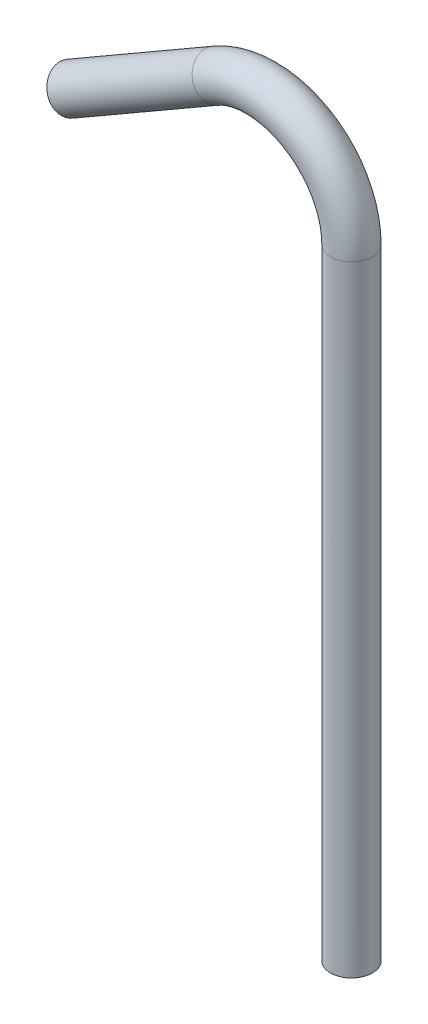
ISO-10303-21;
HEADER;
FILE_DESCRIPTION(('STEP AP214'),'2;1');
FILE_NAME('part.step','',(''),(''),'','','');
FILE_SCHEMA(('AUTOMOTIVE_DESIGN { 1 0 10303 214 1 1 1 1 }'));
ENDSEC;
DATA;
#1=APPLICATION_CONTEXT('core data for automotive mechanical design processes');
#2=APPLICATION_PROTOCOL_DEFINITION('international standard','automotive_design',2000,#1);
#3=PRODUCT_CONTEXT('',#1,'mechanical');
#4=PRODUCT('Part','Part','',(#3));
#5=PRODUCT_RELATED_PRODUCT_CATEGORY('part','',(#4));
#6=PRODUCT_DEFINITION_FORMATION('','',#4);
#7=PRODUCT_DEFINITION_CONTEXT('part definition',#1,'design');
#8=PRODUCT_DEFINITION('design','',#6,#7);
#9=PRODUCT_DEFINITION_SHAPE('','',#8);
#10=(LENGTH_UNIT() NAMED_UNIT(*) SI_UNIT(.MILLI.,.METRE.));
#11=(NAMED_UNIT(*) PLANE_ANGLE_UNIT() SI_UNIT($,.RADIAN.));
#12=(NAMED_UNIT(*) SI_UNIT($,.STERADIAN.) SOLID_ANGLE_UNIT());
#13=UNCERTAINTY_MEASURE_WITH_UNIT(LENGTH_MEASURE(1.E-05),#10,'distance_accuracy_value','');
#14=(GEOMETRIC_REPRESENTATION_CONTEXT(3) GLOBAL_UNCERTAINTY_ASSIGNED_CONTEXT((#13)) GLOBAL_UNIT_ASSIGNED_CONTEXT((#10,
#11,#12)) REPRESENTATION_CONTEXT('',''));
#15=CARTESIAN_POINT('',(0.,0.,0.));
#16=DIRECTION('',(0.,0.,1.));
#17=DIRECTION('',(1.,0.,0.));
#18=AXIS2_PLACEMENT_3D('',#15,#16,#17);
#19=CARTESIAN_POINT('',(-20.574,105.762008577076,0.));
#20=DIRECTION('',(-0.86602540378444,-0.499999999999998,0.));
#21=DIRECTION('',(0.499999999999998,-0.86602540378444,0.));
#22=AXIS2_PLACEMENT_3D('',#19,#20,#21);
#23=CYLINDRICAL_SURFACE('',#22,3.175);
#24=CARTESIAN_POINT('',(-20.574,105.762008577076,0.));
#25=DIRECTION('',(-0.86602540378444,-0.499999999999998,0.));
#26=DIRECTION('',(0.,0.,1.));
#27=AXIS2_PLACEMENT_3D('',#24,#25,#26);
#28=CIRCLE('',#27,3.175);
#29=CARTESIAN_POINT('',(-22.1615,108.511639234092,0.));
#30=VERTEX_POINT('',#29);
#31=EDGE_CURVE('E41',#30,#30,#28,.T.);
#32=ORIENTED_EDGE('',*,*,#31,.T.);
#33=EDGE_LOOP('',(#32));
#34=FACE_BOUND('',#33,.T.);
#35=CARTESIAN_POINT('',(-42.5710452561247,93.0620085770762,0.));
#36=DIRECTION('',(-0.86602540378444,-0.499999999999998,0.));
#37=DIRECTION('',(0.,0.,1.));
#38=AXIS2_PLACEMENT_3D('',#35,#36,#37);
#39=CIRCLE('',#38,3.175);
#40=CARTESIAN_POINT('',(-42.5710452561247,93.0620085770762,3.175));
#41=VERTEX_POINT('',#40);
#42=EDGE_CURVE('E10',#41,#41,#39,.T.);
#43=ORIENTED_EDGE('',*,*,#42,.F.);
#44=EDGE_LOOP('',(#43));
#45=FACE_BOUND('',#44,.T.);
#46=ADVANCED_FACE('F31',(#34,#45),#23,.T.);
#47=CARTESIAN_POINT('',(-20.574,105.762008577076,0.));
#48=DIRECTION('',(-0.86602540378444,-0.499999999999998,0.));
#49=DIRECTION('',(0.499999999999998,-0.86602540378444,0.));
#50=AXIS2_PLACEMENT_3D('',#47,#48,#49);
#51=CYLINDRICAL_SURFACE('',#50,2.16);
#52=CARTESIAN_POINT('',(-20.574,105.762008577076,0.));
#53=DIRECTION('',(-0.86602540378444,-0.499999999999998,0.));
#54=DIRECTION('',(0.,0.,1.));
#55=AXIS2_PLACEMENT_3D('',#52,#53,#54);
#56=CIRCLE('',#55,2.16);
#57=CARTESIAN_POINT('',(-21.654,107.632623449251,0.));
#58=VERTEX_POINT('',#57);
#59=EDGE_CURVE('E45',#58,#58,#56,.T.);
#60=ORIENTED_EDGE('',*,*,#59,.F.);
#61=EDGE_LOOP('',(#60));
#62=FACE_BOUND('',#61,.T.);
#63=CARTESIAN_POINT('',(-42.5710452561247,93.0620085770762,0.));
#64=DIRECTION('',(-0.86602540378444,-0.499999999999998,0.));
#65=DIRECTION('',(0.,0.,1.));
#66=AXIS2_PLACEMENT_3D('',#63,#64,#65);
#67=CIRCLE('',#66,2.16);
#68=CARTESIAN_POINT('',(-42.5710452561247,93.0620085770762,2.16));
#69=VERTEX_POINT('',#68);
#70=EDGE_CURVE('E37',#69,#69,#67,.T.);
#71=ORIENTED_EDGE('',*,*,#70,.T.);
#72=EDGE_LOOP('',(#71));
#73=FACE_BOUND('',#72,.T.);
#74=ADVANCED_FACE('F73',(#62,#73),#51,.F.);
#75=CARTESIAN_POINT('',(-13.716,93.8836041387688,0.));
#76=DIRECTION('',(0.,0.,1.));
#77=DIRECTION('',(1.,0.,0.));
#78=AXIS2_PLACEMENT_3D('',#75,#76,#77);
#79=TOROIDAL_SURFACE('',#78,13.716,3.175);
#80=CARTESIAN_POINT('',(0.,93.8836041387688,0.));
#81=DIRECTION('',(0.,1.,0.));
#82=DIRECTION('',(0.,0.,1.));
#83=AXIS2_PLACEMENT_3D('',#80,#81,#82);
#84=CIRCLE('',#83,3.175);
#85=CARTESIAN_POINT('',(3.175,93.8836041387688,0.));
#86=VERTEX_POINT('',#85);
#87=EDGE_CURVE('E50',#86,#86,#84,.T.);
#88=CARTESIAN_POINT('',(-13.716,93.8836041387688,0.));
#89=DIRECTION('',(0.,0.,1.));
#90=DIRECTION('',(1.,0.,0.));
#91=AXIS2_PLACEMENT_3D('',#88,#89,#90);
#92=CIRCLE('',#91,16.891);
#93=EDGE_CURVE('',#86,#30,#92,.T.);
#94=ORIENTED_EDGE('',*,*,#87,.T.);
#95=ORIENTED_EDGE('',*,*,#31,.F.);
#96=ORIENTED_EDGE('',*,*,#93,.T.);
#97=ORIENTED_EDGE('',*,*,#93,.F.);
#98=EDGE_LOOP('',(#94,#96,#95,#97));
#99=FACE_BOUND('',#98,.T.);
#100=ADVANCED_FACE('F69',(#99),#79,.T.);
#101=CARTESIAN_POINT('',(-13.716,93.8836041387688,0.));
#102=DIRECTION('',(0.,0.,1.));
#103=DIRECTION('',(1.,0.,0.));
#104=AXIS2_PLACEMENT_3D('',#101,#102,#103);
#105=TOROIDAL_SURFACE('',#104,13.716,2.16);
#106=CARTESIAN_POINT('',(0.,93.8836041387688,0.));
#107=DIRECTION('',(0.,1.,0.));
#108=DIRECTION('',(0.,0.,1.));
#109=AXIS2_PLACEMENT_3D('',#106,#107,#108);
#110=CIRCLE('',#109,2.16);
#111=CARTESIAN_POINT('',(2.16000000000001,93.8836041387688,0.));
#112=VERTEX_POINT('',#111);
#113=EDGE_CURVE('E54',#112,#112,#110,.T.);
#114=CARTESIAN_POINT('',(-13.716,93.8836041387688,0.));
#115=DIRECTION('',(0.,0.,1.));
#116=DIRECTION('',(1.,0.,0.));
#117=AXIS2_PLACEMENT_3D('',#114,#115,#116);
#118=CIRCLE('',#117,15.876);
#119=EDGE_CURVE('',#112,#58,#118,.T.);
#120=ORIENTED_EDGE('',*,*,#113,.F.);
#121=ORIENTED_EDGE('',*,*,#59,.T.);
#122=ORIENTED_EDGE('',*,*,#119,.T.);
#123=ORIENTED_EDGE('',*,*,#119,.F.);
#124=EDGE_LOOP('',(#120,#122,#121,#123));
#125=FACE_BOUND('',#124,.T.);
#126=ADVANCED_FACE('F66',(#125),#105,.F.);
#127=CARTESIAN_POINT('',(0.,93.8836041387688,0.));
#128=DIRECTION('',(0.,-1.,0.));
#129=DIRECTION('',(1.,0.,0.));
#130=AXIS2_PLACEMENT_3D('',#127,#128,#129);
#131=CYLINDRICAL_SURFACE('',#130,2.16);
#132=ORIENTED_EDGE('',*,*,#113,.T.);
#133=EDGE_LOOP('',(#132));
#134=FACE_BOUND('',#133,.T.);
#135=CARTESIAN_POINT('',(0.,0.,0.));
#136=DIRECTION('',(0.,1.,0.));
#137=DIRECTION('',(0.,0.,1.));
#138=AXIS2_PLACEMENT_3D('',#135,#136,#137);
#139=CIRCLE('',#138,2.16);
#140=CARTESIAN_POINT('',(0.,0.,2.16));
#141=VERTEX_POINT('',#140);
#142=EDGE_CURVE('E55',#141,#141,#139,.T.);
#143=ORIENTED_EDGE('',*,*,#142,.F.);
#144=EDGE_LOOP('',(#143));
#145=FACE_BOUND('',#144,.T.);
#146=ADVANCED_FACE('F63',(#134,#145),#131,.F.);
#147=CARTESIAN_POINT('',(0.,93.8836041387688,0.));
#148=DIRECTION('',(0.,-1.,0.));
#149=DIRECTION('',(1.,0.,0.));
#150=AXIS2_PLACEMENT_3D('',#147,#148,#149);
#151=CYLINDRICAL_SURFACE('',#150,3.175);
#152=ORIENTED_EDGE('',*,*,#87,.F.);
#153=EDGE_LOOP('',(#152));
#154=FACE_BOUND('',#153,.T.);
#155=CARTESIAN_POINT('',(0.,0.,0.));
#156=DIRECTION('',(0.,1.,0.));
#157=DIRECTION('',(0.,0.,1.));
#158=AXIS2_PLACEMENT_3D('',#155,#156,#157);
#159=CIRCLE('',#158,3.175);
#160=CARTESIAN_POINT('',(0.,0.,3.175));
#161=VERTEX_POINT('',#160);
#162=EDGE_CURVE('E51',#161,#161,#159,.T.);
#163=ORIENTED_EDGE('',*,*,#162,.T.);
#164=EDGE_LOOP('',(#163));
#165=FACE_BOUND('',#164,.T.);
#166=ADVANCED_FACE('F85',(#154,#165),#151,.T.);
#167=CARTESIAN_POINT('',(-42.5710452561247,93.0620085770762,0.));
#168=DIRECTION('',(-0.86602540378444,-0.499999999999998,0.));
#169=DIRECTION('',(0.,0.,1.));
#170=AXIS2_PLACEMENT_3D('',#167,#168,#169);
#171=PLANE('',#170);
#172=ORIENTED_EDGE('',*,*,#70,.F.);
#173=EDGE_LOOP('',(#172));
#174=FACE_BOUND('',#173,.T.);
#175=ORIENTED_EDGE('',*,*,#42,.T.);
#176=EDGE_LOOP('',(#175));
#177=FACE_BOUND('',#176,.T.);
#178=ADVANCED_FACE('F88',(#174,#177),#171,.T.);
#179=CARTESIAN_POINT('',(0.,0.,0.));
#180=DIRECTION('',(0.,1.,0.));
#181=DIRECTION('',(0.,0.,1.));
#182=AXIS2_PLACEMENT_3D('',#179,#180,#181);
#183=PLANE('',#182);
#184=ORIENTED_EDGE('',*,*,#142,.T.);
#185=EDGE_LOOP('',(#184));
#186=FACE_BOUND('',#185,.T.);
#187=ORIENTED_EDGE('',*,*,#162,.F.);
#188=EDGE_LOOP('',(#187));
#189=FACE_BOUND('',#188,.T.);
#190=ADVANCED_FACE('F90',(#186,#189),#183,.F.);
#191=CLOSED_SHELL('',(#46,#74,#100,#126,#146,#166,#178,#190));
#192=MANIFOLD_SOLID_BREP('B2',#191);
#193=ADVANCED_BREP_SHAPE_REPRESENTATION('',(#18,#192),#14);
#194=SHAPE_DEFINITION_REPRESENTATION(#9,#193);
ENDSEC;
END-ISO-10303-21;
